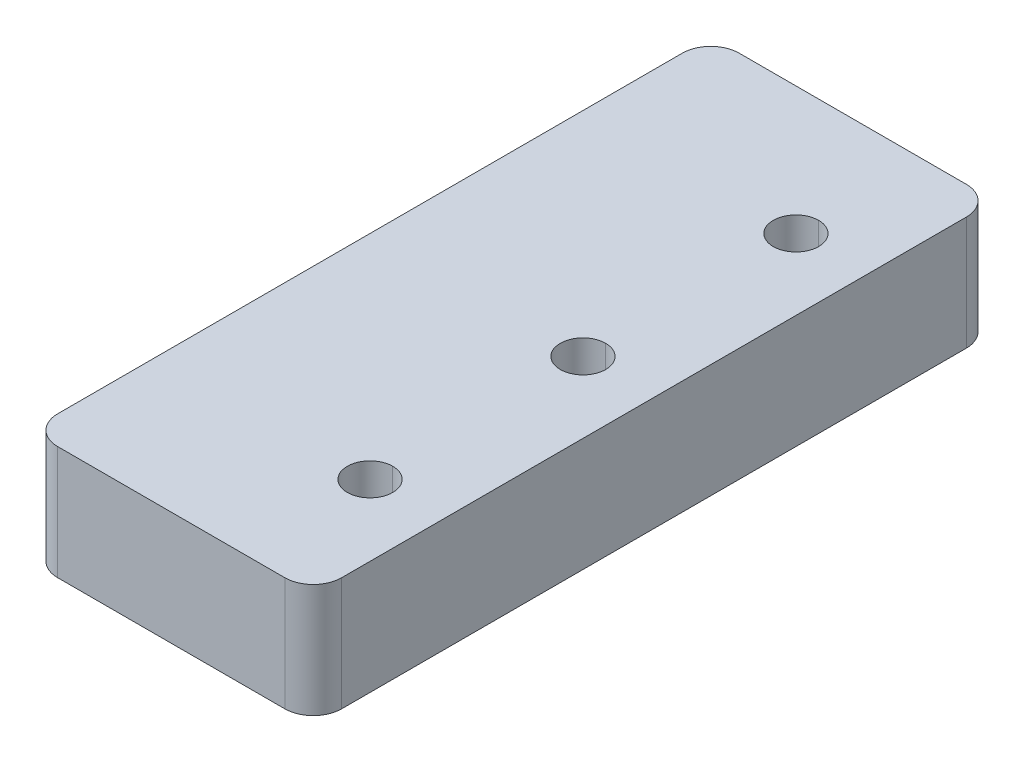
ISO-10303-21;
HEADER;
FILE_DESCRIPTION(('STEP AP214'),'2;1');
FILE_NAME('part.step','',(''),(''),'','','');
FILE_SCHEMA(('AUTOMOTIVE_DESIGN { 1 0 10303 214 1 1 1 1 }'));
ENDSEC;
DATA;
#1=APPLICATION_CONTEXT('core data for automotive mechanical design processes');
#2=APPLICATION_PROTOCOL_DEFINITION('international standard','automotive_design',2000,#1);
#3=PRODUCT_CONTEXT('',#1,'mechanical');
#4=PRODUCT('Part','Part','',(#3));
#5=PRODUCT_RELATED_PRODUCT_CATEGORY('part','',(#4));
#6=PRODUCT_DEFINITION_FORMATION('','',#4);
#7=PRODUCT_DEFINITION_CONTEXT('part definition',#1,'design');
#8=PRODUCT_DEFINITION('design','',#6,#7);
#9=PRODUCT_DEFINITION_SHAPE('','',#8);
#10=(LENGTH_UNIT() NAMED_UNIT(*) SI_UNIT(.MILLI.,.METRE.));
#11=(NAMED_UNIT(*) PLANE_ANGLE_UNIT() SI_UNIT($,.RADIAN.));
#12=(NAMED_UNIT(*) SI_UNIT($,.STERADIAN.) SOLID_ANGLE_UNIT());
#13=UNCERTAINTY_MEASURE_WITH_UNIT(LENGTH_MEASURE(1.E-05),#10,'distance_accuracy_value','');
#14=(GEOMETRIC_REPRESENTATION_CONTEXT(3) GLOBAL_UNCERTAINTY_ASSIGNED_CONTEXT((#13)) GLOBAL_UNIT_ASSIGNED_CONTEXT((#10,
#11,#12)) REPRESENTATION_CONTEXT('',''));
#15=CARTESIAN_POINT('',(0.,0.,0.));
#16=DIRECTION('',(0.,0.,1.));
#17=DIRECTION('',(1.,0.,0.));
#18=AXIS2_PLACEMENT_3D('',#15,#16,#17);
#19=CARTESIAN_POINT('',(3.,8.,22.));
#20=DIRECTION('',(0.,-1.,0.));
#21=DIRECTION('',(0.,0.,-1.));
#22=AXIS2_PLACEMENT_3D('',#19,#20,#21);
#23=CYLINDRICAL_SURFACE('',#22,2.);
#24=CARTESIAN_POINT('',(3.,8.,22.));
#25=DIRECTION('',(0.,1.,0.));
#26=DIRECTION('',(0.,0.,-1.));
#27=AXIS2_PLACEMENT_3D('',#24,#25,#26);
#28=CIRCLE('',#27,2.);
#29=CARTESIAN_POINT('',(3.,8.,24.));
#30=VERTEX_POINT('',#29);
#31=CARTESIAN_POINT('',(5.,8.,22.));
#32=VERTEX_POINT('',#31);
#33=EDGE_CURVE('E179',#30,#32,#28,.T.);
#34=ORIENTED_EDGE('',*,*,#33,.F.);
#35=DIRECTION('',(0.,1.,0.));
#36=VECTOR('',#35,1.);
#37=CARTESIAN_POINT('',(3.,8.,24.));
#38=LINE('',#37,#36);
#39=CARTESIAN_POINT('',(3.,0.,24.));
#40=VERTEX_POINT('',#39);
#41=EDGE_CURVE('E164',#40,#30,#38,.T.);
#42=ORIENTED_EDGE('',*,*,#41,.F.);
#43=CARTESIAN_POINT('',(3.,0.,22.));
#44=DIRECTION('',(0.,-1.,0.));
#45=DIRECTION('',(0.,0.,-1.));
#46=AXIS2_PLACEMENT_3D('',#43,#44,#45);
#47=CIRCLE('',#46,2.);
#48=CARTESIAN_POINT('',(5.,0.,22.));
#49=VERTEX_POINT('',#48);
#50=EDGE_CURVE('E242',#49,#40,#47,.T.);
#51=ORIENTED_EDGE('',*,*,#50,.F.);
#52=DIRECTION('',(0.,-1.,0.));
#53=VECTOR('',#52,1.);
#54=CARTESIAN_POINT('',(5.,8.,22.));
#55=LINE('',#54,#53);
#56=EDGE_CURVE('E10',#32,#49,#55,.T.);
#57=ORIENTED_EDGE('',*,*,#56,.F.);
#58=EDGE_LOOP('',(#34,#42,#51,#57));
#59=FACE_BOUND('',#58,.T.);
#60=ADVANCED_FACE('F16',(#59),#23,.T.);
#61=CARTESIAN_POINT('',(-13.,8.,-22.));
#62=DIRECTION('',(0.,-1.,0.));
#63=DIRECTION('',(0.,0.,-1.));
#64=AXIS2_PLACEMENT_3D('',#61,#62,#63);
#65=CYLINDRICAL_SURFACE('',#64,2.);
#66=CARTESIAN_POINT('',(-13.,8.,-22.));
#67=DIRECTION('',(0.,1.,0.));
#68=DIRECTION('',(0.,0.,-1.));
#69=AXIS2_PLACEMENT_3D('',#66,#67,#68);
#70=CIRCLE('',#69,2.);
#71=CARTESIAN_POINT('',(-13.,8.,-24.));
#72=VERTEX_POINT('',#71);
#73=CARTESIAN_POINT('',(-15.,8.,-22.));
#74=VERTEX_POINT('',#73);
#75=EDGE_CURVE('E209',#72,#74,#70,.T.);
#76=ORIENTED_EDGE('',*,*,#75,.F.);
#77=DIRECTION('',(0.,1.,0.));
#78=VECTOR('',#77,1.);
#79=CARTESIAN_POINT('',(-13.,8.,-24.));
#80=LINE('',#79,#78);
#81=CARTESIAN_POINT('',(-13.,0.,-24.));
#82=VERTEX_POINT('',#81);
#83=EDGE_CURVE('E269',#82,#72,#80,.T.);
#84=ORIENTED_EDGE('',*,*,#83,.F.);
#85=CARTESIAN_POINT('',(-13.,0.,-22.));
#86=DIRECTION('',(0.,-1.,0.));
#87=DIRECTION('',(0.,0.,-1.));
#88=AXIS2_PLACEMENT_3D('',#85,#86,#87);
#89=CIRCLE('',#88,2.);
#90=CARTESIAN_POINT('',(-15.,0.,-22.));
#91=VERTEX_POINT('',#90);
#92=EDGE_CURVE('E254',#91,#82,#89,.T.);
#93=ORIENTED_EDGE('',*,*,#92,.F.);
#94=DIRECTION('',(0.,-1.,0.));
#95=VECTOR('',#94,1.);
#96=CARTESIAN_POINT('',(-15.,8.,-22.));
#97=LINE('',#96,#95);
#98=EDGE_CURVE('E37',#74,#91,#97,.T.);
#99=ORIENTED_EDGE('',*,*,#98,.F.);
#100=EDGE_LOOP('',(#76,#84,#93,#99));
#101=FACE_BOUND('',#100,.T.);
#102=ADVANCED_FACE('F350',(#101),#65,.T.);
#103=CARTESIAN_POINT('',(-13.,8.,22.));
#104=DIRECTION('',(0.,-1.,0.));
#105=DIRECTION('',(0.,0.,-1.));
#106=AXIS2_PLACEMENT_3D('',#103,#104,#105);
#107=CYLINDRICAL_SURFACE('',#106,2.);
#108=CARTESIAN_POINT('',(-13.,8.,22.));
#109=DIRECTION('',(0.,1.,0.));
#110=DIRECTION('',(0.,0.,-1.));
#111=AXIS2_PLACEMENT_3D('',#108,#109,#110);
#112=CIRCLE('',#111,2.);
#113=CARTESIAN_POINT('',(-15.,8.,22.));
#114=VERTEX_POINT('',#113);
#115=CARTESIAN_POINT('',(-13.,8.,24.));
#116=VERTEX_POINT('',#115);
#117=EDGE_CURVE('E217',#114,#116,#112,.T.);
#118=ORIENTED_EDGE('',*,*,#117,.F.);
#119=DIRECTION('',(0.,1.,0.));
#120=VECTOR('',#119,1.);
#121=CARTESIAN_POINT('',(-15.,8.,22.));
#122=LINE('',#121,#120);
#123=CARTESIAN_POINT('',(-15.,0.,22.));
#124=VERTEX_POINT('',#123);
#125=EDGE_CURVE('E48',#124,#114,#122,.T.);
#126=ORIENTED_EDGE('',*,*,#125,.F.);
#127=CARTESIAN_POINT('',(-13.,0.,22.));
#128=DIRECTION('',(0.,-1.,0.));
#129=DIRECTION('',(0.,0.,-1.));
#130=AXIS2_PLACEMENT_3D('',#127,#128,#129);
#131=CIRCLE('',#130,2.);
#132=CARTESIAN_POINT('',(-13.,0.,24.));
#133=VERTEX_POINT('',#132);
#134=EDGE_CURVE('E247',#133,#124,#131,.T.);
#135=ORIENTED_EDGE('',*,*,#134,.F.);
#136=DIRECTION('',(0.,-1.,0.));
#137=VECTOR('',#136,1.);
#138=CARTESIAN_POINT('',(-13.,8.,24.));
#139=LINE('',#138,#137);
#140=EDGE_CURVE('E276',#116,#133,#139,.T.);
#141=ORIENTED_EDGE('',*,*,#140,.F.);
#142=EDGE_LOOP('',(#118,#126,#135,#141));
#143=FACE_BOUND('',#142,.T.);
#144=ADVANCED_FACE('F289',(#143),#107,.T.);
#145=CARTESIAN_POINT('',(3.,8.,-22.));
#146=DIRECTION('',(0.,-1.,0.));
#147=DIRECTION('',(0.,0.,-1.));
#148=AXIS2_PLACEMENT_3D('',#145,#146,#147);
#149=CYLINDRICAL_SURFACE('',#148,2.);
#150=CARTESIAN_POINT('',(3.,8.,-22.));
#151=DIRECTION('',(0.,1.,0.));
#152=DIRECTION('',(0.,0.,-1.));
#153=AXIS2_PLACEMENT_3D('',#150,#151,#152);
#154=CIRCLE('',#153,2.);
#155=CARTESIAN_POINT('',(5.,8.,-22.));
#156=VERTEX_POINT('',#155);
#157=CARTESIAN_POINT('',(3.,8.,-24.));
#158=VERTEX_POINT('',#157);
#159=EDGE_CURVE('E166',#156,#158,#154,.T.);
#160=ORIENTED_EDGE('',*,*,#159,.F.);
#161=DIRECTION('',(0.,1.,0.));
#162=VECTOR('',#161,1.);
#163=CARTESIAN_POINT('',(5.,8.,-22.));
#164=LINE('',#163,#162);
#165=CARTESIAN_POINT('',(5.,0.,-22.));
#166=VERTEX_POINT('',#165);
#167=EDGE_CURVE('E24',#166,#156,#164,.T.);
#168=ORIENTED_EDGE('',*,*,#167,.F.);
#169=CARTESIAN_POINT('',(3.,0.,-22.));
#170=DIRECTION('',(0.,-1.,0.));
#171=DIRECTION('',(0.,0.,-1.));
#172=AXIS2_PLACEMENT_3D('',#169,#170,#171);
#173=CIRCLE('',#172,2.);
#174=CARTESIAN_POINT('',(3.,0.,-24.));
#175=VERTEX_POINT('',#174);
#176=EDGE_CURVE('E230',#175,#166,#173,.T.);
#177=ORIENTED_EDGE('',*,*,#176,.F.);
#178=DIRECTION('',(0.,-1.,0.));
#179=VECTOR('',#178,1.);
#180=CARTESIAN_POINT('',(3.,8.,-24.));
#181=LINE('',#180,#179);
#182=EDGE_CURVE('E168',#158,#175,#181,.T.);
#183=ORIENTED_EDGE('',*,*,#182,.F.);
#184=EDGE_LOOP('',(#160,#168,#177,#183));
#185=FACE_BOUND('',#184,.T.);
#186=ADVANCED_FACE('F167',(#185),#149,.T.);
#187=CARTESIAN_POINT('',(0.,8.,-15.));
#188=DIRECTION('',(0.,-1.,0.));
#189=DIRECTION('',(0.,0.,-1.));
#190=AXIS2_PLACEMENT_3D('',#187,#188,#189);
#191=CYLINDRICAL_SURFACE('',#190,1.6);
#192=DIRECTION('',(0.,-1.,0.));
#193=VECTOR('',#192,1.);
#194=CARTESIAN_POINT('',(0.,8.,-13.4));
#195=LINE('',#194,#193);
#196=CARTESIAN_POINT('',(0.,8.,-13.4));
#197=VERTEX_POINT('',#196);
#198=CARTESIAN_POINT('',(0.,0.,-13.4));
#199=VERTEX_POINT('',#198);
#200=EDGE_CURVE('E309',#197,#199,#195,.T.);
#201=ORIENTED_EDGE('',*,*,#200,.F.);
#202=CARTESIAN_POINT('',(0.,8.,-15.));
#203=DIRECTION('',(0.,1.,0.));
#204=DIRECTION('',(0.,0.,1.));
#205=AXIS2_PLACEMENT_3D('',#202,#203,#204);
#206=CIRCLE('',#205,1.6);
#207=CARTESIAN_POINT('',(0.,8.,-16.6));
#208=VERTEX_POINT('',#207);
#209=EDGE_CURVE('E236',#197,#208,#206,.T.);
#210=ORIENTED_EDGE('',*,*,#209,.T.);
#211=DIRECTION('',(0.,-1.,0.));
#212=VECTOR('',#211,1.);
#213=CARTESIAN_POINT('',(0.,8.,-16.6));
#214=LINE('',#213,#212);
#215=CARTESIAN_POINT('',(0.,0.,-16.6));
#216=VERTEX_POINT('',#215);
#217=EDGE_CURVE('E308',#208,#216,#214,.T.);
#218=ORIENTED_EDGE('',*,*,#217,.T.);
#219=CARTESIAN_POINT('',(0.,0.,-15.));
#220=DIRECTION('',(0.,1.,0.));
#221=DIRECTION('',(0.,0.,1.));
#222=AXIS2_PLACEMENT_3D('',#219,#220,#221);
#223=CIRCLE('',#222,1.6);
#224=EDGE_CURVE('E264',#199,#216,#223,.T.);
#225=ORIENTED_EDGE('',*,*,#224,.F.);
#226=EDGE_LOOP('',(#201,#210,#218,#225));
#227=FACE_BOUND('',#226,.T.);
#228=ADVANCED_FACE('F365',(#227),#191,.F.);
#229=CARTESIAN_POINT('',(0.,8.,0.));
#230=DIRECTION('',(0.,-1.,0.));
#231=DIRECTION('',(0.,0.,-1.));
#232=AXIS2_PLACEMENT_3D('',#229,#230,#231);
#233=CYLINDRICAL_SURFACE('',#232,1.6);
#234=DIRECTION('',(0.,-1.,0.));
#235=VECTOR('',#234,1.);
#236=CARTESIAN_POINT('',(0.,8.,1.6));
#237=LINE('',#236,#235);
#238=CARTESIAN_POINT('',(0.,8.,1.6));
#239=VERTEX_POINT('',#238);
#240=CARTESIAN_POINT('',(0.,0.,1.6));
#241=VERTEX_POINT('',#240);
#242=EDGE_CURVE('E193',#239,#241,#237,.T.);
#243=ORIENTED_EDGE('',*,*,#242,.F.);
#244=CARTESIAN_POINT('',(0.,8.,0.));
#245=DIRECTION('',(0.,1.,0.));
#246=DIRECTION('',(0.,0.,1.));
#247=AXIS2_PLACEMENT_3D('',#244,#245,#246);
#248=CIRCLE('',#247,1.6);
#249=CARTESIAN_POINT('',(0.,8.,-1.6));
#250=VERTEX_POINT('',#249);
#251=EDGE_CURVE('E229',#239,#250,#248,.T.);
#252=ORIENTED_EDGE('',*,*,#251,.T.);
#253=DIRECTION('',(0.,-1.,0.));
#254=VECTOR('',#253,1.);
#255=CARTESIAN_POINT('',(0.,8.,-1.6));
#256=LINE('',#255,#254);
#257=CARTESIAN_POINT('',(0.,0.,-1.6));
#258=VERTEX_POINT('',#257);
#259=EDGE_CURVE('E195',#250,#258,#256,.T.);
#260=ORIENTED_EDGE('',*,*,#259,.T.);
#261=CARTESIAN_POINT('',(0.,0.,0.));
#262=DIRECTION('',(0.,1.,0.));
#263=DIRECTION('',(0.,0.,1.));
#264=AXIS2_PLACEMENT_3D('',#261,#262,#263);
#265=CIRCLE('',#264,1.6);
#266=EDGE_CURVE('E258',#241,#258,#265,.T.);
#267=ORIENTED_EDGE('',*,*,#266,.F.);
#268=EDGE_LOOP('',(#243,#252,#260,#267));
#269=FACE_BOUND('',#268,.T.);
#270=ADVANCED_FACE('F329',(#269),#233,.F.);
#271=CARTESIAN_POINT('',(0.,8.,15.));
#272=DIRECTION('',(0.,-1.,0.));
#273=DIRECTION('',(0.,0.,-1.));
#274=AXIS2_PLACEMENT_3D('',#271,#272,#273);
#275=CYLINDRICAL_SURFACE('',#274,1.6);
#276=DIRECTION('',(0.,-1.,0.));
#277=VECTOR('',#276,1.);
#278=CARTESIAN_POINT('',(0.,8.,16.6));
#279=LINE('',#278,#277);
#280=CARTESIAN_POINT('',(0.,8.,16.6));
#281=VERTEX_POINT('',#280);
#282=CARTESIAN_POINT('',(0.,0.,16.6));
#283=VERTEX_POINT('',#282);
#284=EDGE_CURVE('E203',#281,#283,#279,.T.);
#285=ORIENTED_EDGE('',*,*,#284,.F.);
#286=CARTESIAN_POINT('',(0.,8.,15.));
#287=DIRECTION('',(0.,1.,0.));
#288=DIRECTION('',(0.,0.,1.));
#289=AXIS2_PLACEMENT_3D('',#286,#287,#288);
#290=CIRCLE('',#289,1.6);
#291=CARTESIAN_POINT('',(0.,8.,13.4));
#292=VERTEX_POINT('',#291);
#293=EDGE_CURVE('E226',#281,#292,#290,.T.);
#294=ORIENTED_EDGE('',*,*,#293,.T.);
#295=DIRECTION('',(0.,-1.,0.));
#296=VECTOR('',#295,1.);
#297=CARTESIAN_POINT('',(0.,8.,13.4));
#298=LINE('',#297,#296);
#299=CARTESIAN_POINT('',(0.,0.,13.4));
#300=VERTEX_POINT('',#299);
#301=EDGE_CURVE('E181',#292,#300,#298,.T.);
#302=ORIENTED_EDGE('',*,*,#301,.T.);
#303=CARTESIAN_POINT('',(0.,0.,15.));
#304=DIRECTION('',(0.,1.,0.));
#305=DIRECTION('',(0.,0.,1.));
#306=AXIS2_PLACEMENT_3D('',#303,#304,#305);
#307=CIRCLE('',#306,1.6);
#308=EDGE_CURVE('E261',#283,#300,#307,.T.);
#309=ORIENTED_EDGE('',*,*,#308,.F.);
#310=EDGE_LOOP('',(#285,#294,#302,#309));
#311=FACE_BOUND('',#310,.T.);
#312=ADVANCED_FACE('F362',(#311),#275,.F.);
#313=CARTESIAN_POINT('',(5.,8.,-24.));
#314=DIRECTION('',(-1.,0.,0.));
#315=DIRECTION('',(0.,0.,1.));
#316=AXIS2_PLACEMENT_3D('',#313,#314,#315);
#317=PLANE('',#316);
#318=DIRECTION('',(0.,0.,-1.));
#319=VECTOR('',#318,1.);
#320=CARTESIAN_POINT('',(5.,0.,-24.));
#321=LINE('',#320,#319);
#322=EDGE_CURVE('E159',#49,#166,#321,.T.);
#323=ORIENTED_EDGE('',*,*,#322,.T.);
#324=ORIENTED_EDGE('',*,*,#167,.T.);
#325=DIRECTION('',(0.,0.,-1.));
#326=VECTOR('',#325,1.);
#327=CARTESIAN_POINT('',(5.,8.,-24.));
#328=LINE('',#327,#326);
#329=EDGE_CURVE('E157',#32,#156,#328,.T.);
#330=ORIENTED_EDGE('',*,*,#329,.F.);
#331=ORIENTED_EDGE('',*,*,#56,.T.);
#332=EDGE_LOOP('',(#323,#324,#330,#331));
#333=FACE_BOUND('',#332,.T.);
#334=ADVANCED_FACE('F155',(#333),#317,.F.);
#335=CARTESIAN_POINT('',(5.,8.,24.));
#336=DIRECTION('',(0.,0.,-1.));
#337=DIRECTION('',(0.,-1.,0.));
#338=AXIS2_PLACEMENT_3D('',#335,#336,#337);
#339=PLANE('',#338);
#340=DIRECTION('',(1.,0.,0.));
#341=VECTOR('',#340,1.);
#342=CARTESIAN_POINT('',(5.,8.,24.));
#343=LINE('',#342,#341);
#344=EDGE_CURVE('E221',#116,#30,#343,.T.);
#345=ORIENTED_EDGE('',*,*,#344,.F.);
#346=ORIENTED_EDGE('',*,*,#140,.T.);
#347=DIRECTION('',(1.,0.,0.));
#348=VECTOR('',#347,1.);
#349=CARTESIAN_POINT('',(5.,0.,24.));
#350=LINE('',#349,#348);
#351=EDGE_CURVE('E243',#133,#40,#350,.T.);
#352=ORIENTED_EDGE('',*,*,#351,.T.);
#353=ORIENTED_EDGE('',*,*,#41,.T.);
#354=EDGE_LOOP('',(#345,#346,#352,#353));
#355=FACE_BOUND('',#354,.T.);
#356=ADVANCED_FACE('F284',(#355),#339,.F.);
#357=CARTESIAN_POINT('',(-15.,8.,24.));
#358=DIRECTION('',(1.,0.,0.));
#359=DIRECTION('',(0.,1.,0.));
#360=AXIS2_PLACEMENT_3D('',#357,#358,#359);
#361=PLANE('',#360);
#362=DIRECTION('',(0.,0.,1.));
#363=VECTOR('',#362,1.);
#364=CARTESIAN_POINT('',(-15.,0.,24.));
#365=LINE('',#364,#363);
#366=EDGE_CURVE('E251',#91,#124,#365,.T.);
#367=ORIENTED_EDGE('',*,*,#366,.T.);
#368=ORIENTED_EDGE('',*,*,#125,.T.);
#369=DIRECTION('',(0.,0.,1.));
#370=VECTOR('',#369,1.);
#371=CARTESIAN_POINT('',(-15.,8.,24.));
#372=LINE('',#371,#370);
#373=EDGE_CURVE('E213',#74,#114,#372,.T.);
#374=ORIENTED_EDGE('',*,*,#373,.F.);
#375=ORIENTED_EDGE('',*,*,#98,.T.);
#376=EDGE_LOOP('',(#367,#368,#374,#375));
#377=FACE_BOUND('',#376,.T.);
#378=ADVANCED_FACE('F343',(#377),#361,.F.);
#379=CARTESIAN_POINT('',(-15.,8.,-24.));
#380=DIRECTION('',(0.,0.,1.));
#381=DIRECTION('',(1.,0.,0.));
#382=AXIS2_PLACEMENT_3D('',#379,#380,#381);
#383=PLANE('',#382);
#384=DIRECTION('',(-1.,0.,0.));
#385=VECTOR('',#384,1.);
#386=CARTESIAN_POINT('',(-15.,8.,-24.));
#387=LINE('',#386,#385);
#388=EDGE_CURVE('E173',#158,#72,#387,.T.);
#389=ORIENTED_EDGE('',*,*,#388,.F.);
#390=ORIENTED_EDGE('',*,*,#182,.T.);
#391=DIRECTION('',(-1.,0.,0.));
#392=VECTOR('',#391,1.);
#393=CARTESIAN_POINT('',(-15.,0.,-24.));
#394=LINE('',#393,#392);
#395=EDGE_CURVE('E233',#175,#82,#394,.T.);
#396=ORIENTED_EDGE('',*,*,#395,.T.);
#397=ORIENTED_EDGE('',*,*,#83,.T.);
#398=EDGE_LOOP('',(#389,#390,#396,#397));
#399=FACE_BOUND('',#398,.T.);
#400=ADVANCED_FACE('F332',(#399),#383,.F.);
#401=CARTESIAN_POINT('',(0.,0.,0.));
#402=DIRECTION('',(0.,-1.,0.));
#403=DIRECTION('',(0.,0.,-1.));
#404=AXIS2_PLACEMENT_3D('',#401,#402,#403);
#405=PLANE('',#404);
#406=CARTESIAN_POINT('',(0.,0.,-15.));
#407=DIRECTION('',(0.,1.,0.));
#408=DIRECTION('',(0.,0.,1.));
#409=AXIS2_PLACEMENT_3D('',#406,#407,#408);
#410=CIRCLE('',#409,1.6);
#411=EDGE_CURVE('E304',#216,#199,#410,.T.);
#412=ORIENTED_EDGE('',*,*,#411,.T.);
#413=ORIENTED_EDGE('',*,*,#224,.T.);
#414=EDGE_LOOP('',(#412,#413));
#415=FACE_BOUND('',#414,.T.);
#416=CARTESIAN_POINT('',(0.,0.,15.));
#417=DIRECTION('',(0.,1.,0.));
#418=DIRECTION('',(0.,0.,1.));
#419=AXIS2_PLACEMENT_3D('',#416,#417,#418);
#420=CIRCLE('',#419,1.6);
#421=EDGE_CURVE('E189',#300,#283,#420,.T.);
#422=ORIENTED_EDGE('',*,*,#421,.T.);
#423=ORIENTED_EDGE('',*,*,#308,.T.);
#424=EDGE_LOOP('',(#422,#423));
#425=FACE_BOUND('',#424,.T.);
#426=CARTESIAN_POINT('',(0.,0.,0.));
#427=DIRECTION('',(0.,1.,0.));
#428=DIRECTION('',(0.,0.,1.));
#429=AXIS2_PLACEMENT_3D('',#426,#427,#428);
#430=CIRCLE('',#429,1.6);
#431=EDGE_CURVE('E199',#258,#241,#430,.T.);
#432=ORIENTED_EDGE('',*,*,#431,.T.);
#433=ORIENTED_EDGE('',*,*,#266,.T.);
#434=EDGE_LOOP('',(#432,#433));
#435=FACE_BOUND('',#434,.T.);
#436=ORIENTED_EDGE('',*,*,#395,.F.);
#437=ORIENTED_EDGE('',*,*,#176,.T.);
#438=ORIENTED_EDGE('',*,*,#322,.F.);
#439=ORIENTED_EDGE('',*,*,#50,.T.);
#440=ORIENTED_EDGE('',*,*,#351,.F.);
#441=ORIENTED_EDGE('',*,*,#134,.T.);
#442=ORIENTED_EDGE('',*,*,#366,.F.);
#443=ORIENTED_EDGE('',*,*,#92,.T.);
#444=EDGE_LOOP('',(#436,#437,#438,#439,#440,#441,#442,#443));
#445=FACE_BOUND('',#444,.T.);
#446=ADVANCED_FACE('F293',(#415,#425,#435,#445),#405,.T.);
#447=CARTESIAN_POINT('',(0.,8.,0.));
#448=DIRECTION('',(0.,-1.,0.));
#449=DIRECTION('',(0.,0.,-1.));
#450=AXIS2_PLACEMENT_3D('',#447,#448,#449);
#451=PLANE('',#450);
#452=CARTESIAN_POINT('',(0.,8.,-15.));
#453=DIRECTION('',(0.,1.,0.));
#454=DIRECTION('',(0.,0.,1.));
#455=AXIS2_PLACEMENT_3D('',#452,#453,#454);
#456=CIRCLE('',#455,1.6);
#457=EDGE_CURVE('E405',#208,#197,#456,.T.);
#458=ORIENTED_EDGE('',*,*,#457,.F.);
#459=ORIENTED_EDGE('',*,*,#209,.F.);
#460=EDGE_LOOP('',(#458,#459));
#461=FACE_BOUND('',#460,.T.);
#462=CARTESIAN_POINT('',(0.,8.,0.));
#463=DIRECTION('',(0.,1.,0.));
#464=DIRECTION('',(0.,0.,1.));
#465=AXIS2_PLACEMENT_3D('',#462,#463,#464);
#466=CIRCLE('',#465,1.6);
#467=EDGE_CURVE('E313',#250,#239,#466,.T.);
#468=ORIENTED_EDGE('',*,*,#467,.F.);
#469=ORIENTED_EDGE('',*,*,#251,.F.);
#470=EDGE_LOOP('',(#468,#469));
#471=FACE_BOUND('',#470,.T.);
#472=CARTESIAN_POINT('',(0.,8.,15.));
#473=DIRECTION('',(0.,1.,0.));
#474=DIRECTION('',(0.,0.,1.));
#475=AXIS2_PLACEMENT_3D('',#472,#473,#474);
#476=CIRCLE('',#475,1.6);
#477=EDGE_CURVE('E198',#292,#281,#476,.T.);
#478=ORIENTED_EDGE('',*,*,#477,.F.);
#479=ORIENTED_EDGE('',*,*,#293,.F.);
#480=EDGE_LOOP('',(#478,#479));
#481=FACE_BOUND('',#480,.T.);
#482=ORIENTED_EDGE('',*,*,#329,.T.);
#483=ORIENTED_EDGE('',*,*,#159,.T.);
#484=ORIENTED_EDGE('',*,*,#388,.T.);
#485=ORIENTED_EDGE('',*,*,#75,.T.);
#486=ORIENTED_EDGE('',*,*,#373,.T.);
#487=ORIENTED_EDGE('',*,*,#117,.T.);
#488=ORIENTED_EDGE('',*,*,#344,.T.);
#489=ORIENTED_EDGE('',*,*,#33,.T.);
#490=EDGE_LOOP('',(#482,#483,#484,#485,#486,#487,#488,#489));
#491=FACE_BOUND('',#490,.T.);
#492=ADVANCED_FACE('F176',(#461,#471,#481,#491),#451,.F.);
#493=CARTESIAN_POINT('',(0.,8.,15.));
#494=DIRECTION('',(0.,-1.,0.));
#495=DIRECTION('',(0.,0.,-1.));
#496=AXIS2_PLACEMENT_3D('',#493,#494,#495);
#497=CYLINDRICAL_SURFACE('',#496,1.6);
#498=ORIENTED_EDGE('',*,*,#477,.T.);
#499=ORIENTED_EDGE('',*,*,#284,.T.);
#500=ORIENTED_EDGE('',*,*,#421,.F.);
#501=ORIENTED_EDGE('',*,*,#301,.F.);
#502=EDGE_LOOP('',(#498,#499,#500,#501));
#503=FACE_BOUND('',#502,.T.);
#504=ADVANCED_FACE('F340',(#503),#497,.F.);
#505=CARTESIAN_POINT('',(0.,8.,0.));
#506=DIRECTION('',(0.,-1.,0.));
#507=DIRECTION('',(0.,0.,-1.));
#508=AXIS2_PLACEMENT_3D('',#505,#506,#507);
#509=CYLINDRICAL_SURFACE('',#508,1.6);
#510=ORIENTED_EDGE('',*,*,#467,.T.);
#511=ORIENTED_EDGE('',*,*,#242,.T.);
#512=ORIENTED_EDGE('',*,*,#431,.F.);
#513=ORIENTED_EDGE('',*,*,#259,.F.);
#514=EDGE_LOOP('',(#510,#511,#512,#513));
#515=FACE_BOUND('',#514,.T.);
#516=ADVANCED_FACE('F327',(#515),#509,.F.);
#517=CARTESIAN_POINT('',(0.,8.,-15.));
#518=DIRECTION('',(0.,-1.,0.));
#519=DIRECTION('',(0.,0.,-1.));
#520=AXIS2_PLACEMENT_3D('',#517,#518,#519);
#521=CYLINDRICAL_SURFACE('',#520,1.6);
#522=ORIENTED_EDGE('',*,*,#457,.T.);
#523=ORIENTED_EDGE('',*,*,#200,.T.);
#524=ORIENTED_EDGE('',*,*,#411,.F.);
#525=ORIENTED_EDGE('',*,*,#217,.F.);
#526=EDGE_LOOP('',(#522,#523,#524,#525));
#527=FACE_BOUND('',#526,.T.);
#528=ADVANCED_FACE('F383',(#527),#521,.F.);
#529=CLOSED_SHELL('',(#60,#102,#144,#186,#228,#270,#312,#334,#356,#378,#400,#446,#492,#504,#516,#528));
#530=MANIFOLD_SOLID_BREP('B1',#529);
#531=ADVANCED_BREP_SHAPE_REPRESENTATION('',(#18,#530),#14);
#532=SHAPE_DEFINITION_REPRESENTATION(#9,#531);
ENDSEC;
END-ISO-10303-21;
